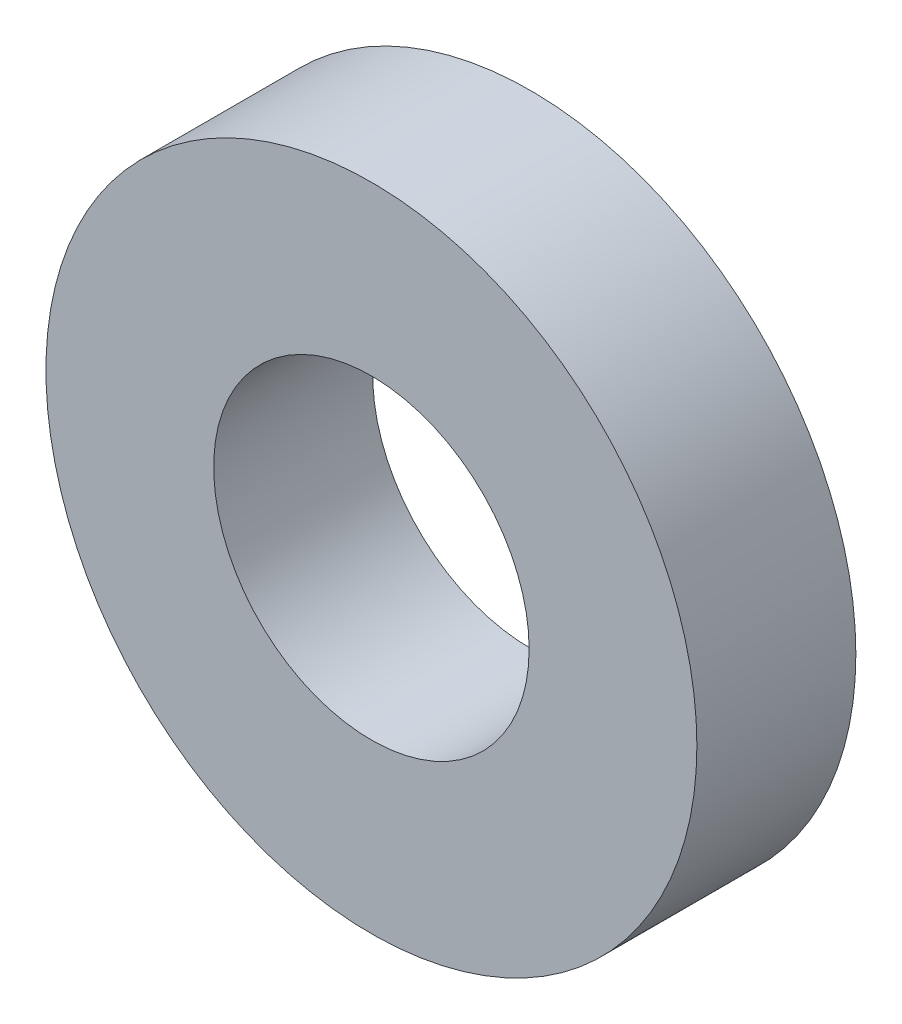
ISO-10303-21;
HEADER;
FILE_DESCRIPTION(('STEP AP214'),'2;1');
FILE_NAME('part.step','',(''),(''),'','','');
FILE_SCHEMA(('AUTOMOTIVE_DESIGN { 1 0 10303 214 1 1 1 1 }'));
ENDSEC;
DATA;
#1=APPLICATION_CONTEXT('core data for automotive mechanical design processes');
#2=APPLICATION_PROTOCOL_DEFINITION('international standard','automotive_design',2000,#1);
#3=PRODUCT_CONTEXT('',#1,'mechanical');
#4=PRODUCT('Part','Part','',(#3));
#5=PRODUCT_RELATED_PRODUCT_CATEGORY('part','',(#4));
#6=PRODUCT_DEFINITION_FORMATION('','',#4);
#7=PRODUCT_DEFINITION_CONTEXT('part definition',#1,'design');
#8=PRODUCT_DEFINITION('design','',#6,#7);
#9=PRODUCT_DEFINITION_SHAPE('','',#8);
#10=(LENGTH_UNIT() NAMED_UNIT(*) SI_UNIT(.MILLI.,.METRE.));
#11=(NAMED_UNIT(*) PLANE_ANGLE_UNIT() SI_UNIT($,.RADIAN.));
#12=(NAMED_UNIT(*) SI_UNIT($,.STERADIAN.) SOLID_ANGLE_UNIT());
#13=UNCERTAINTY_MEASURE_WITH_UNIT(LENGTH_MEASURE(1.E-05),#10,'distance_accuracy_value','');
#14=(GEOMETRIC_REPRESENTATION_CONTEXT(3) GLOBAL_UNCERTAINTY_ASSIGNED_CONTEXT((#13)) GLOBAL_UNIT_ASSIGNED_CONTEXT((#10,
#11,#12)) REPRESENTATION_CONTEXT('',''));
#15=CARTESIAN_POINT('',(0.,0.,0.));
#16=DIRECTION('',(0.,0.,1.));
#17=DIRECTION('',(1.,0.,0.));
#18=AXIS2_PLACEMENT_3D('',#15,#16,#17);
#19=CARTESIAN_POINT('',(0.,0.,1.5875));
#20=DIRECTION('',(0.,0.,1.));
#21=DIRECTION('',(1.,0.,0.));
#22=AXIS2_PLACEMENT_3D('',#19,#20,#21);
#23=PLANE('',#22);
#24=CARTESIAN_POINT('',(0.,0.,1.5875));
#25=DIRECTION('',(0.,0.,1.));
#26=DIRECTION('',(1.,0.,0.));
#27=AXIS2_PLACEMENT_3D('',#24,#25,#26);
#28=CIRCLE('',#27,6.5);
#29=CARTESIAN_POINT('',(6.5,0.,1.5875));
#30=VERTEX_POINT('',#29);
#31=EDGE_CURVE('E10',#30,#30,#28,.T.);
#32=ORIENTED_EDGE('',*,*,#31,.T.);
#33=EDGE_LOOP('',(#32));
#34=FACE_BOUND('',#33,.T.);
#35=CARTESIAN_POINT('',(0.,0.,1.5875));
#36=DIRECTION('',(0.,0.,1.));
#37=DIRECTION('',(1.,0.,0.));
#38=AXIS2_PLACEMENT_3D('',#35,#36,#37);
#39=CIRCLE('',#38,3.15);
#40=CARTESIAN_POINT('',(3.15,0.,1.5875));
#41=VERTEX_POINT('',#40);
#42=EDGE_CURVE('E50',#41,#41,#39,.T.);
#43=ORIENTED_EDGE('',*,*,#42,.F.);
#44=EDGE_LOOP('',(#43));
#45=FACE_BOUND('',#44,.T.);
#46=ADVANCED_FACE('F37',(#34,#45),#23,.T.);
#47=CARTESIAN_POINT('',(0.,0.,-1.5875));
#48=DIRECTION('',(0.,0.,1.));
#49=DIRECTION('',(1.,0.,0.));
#50=AXIS2_PLACEMENT_3D('',#47,#48,#49);
#51=PLANE('',#50);
#52=CARTESIAN_POINT('',(0.,0.,-1.5875));
#53=DIRECTION('',(0.,0.,1.));
#54=DIRECTION('',(1.,0.,0.));
#55=AXIS2_PLACEMENT_3D('',#52,#53,#54);
#56=CIRCLE('',#55,6.5);
#57=CARTESIAN_POINT('',(6.5,0.,-1.5875));
#58=VERTEX_POINT('',#57);
#59=EDGE_CURVE('E41',#58,#58,#56,.T.);
#60=ORIENTED_EDGE('',*,*,#59,.F.);
#61=EDGE_LOOP('',(#60));
#62=FACE_BOUND('',#61,.T.);
#63=CARTESIAN_POINT('',(0.,0.,-1.5875));
#64=DIRECTION('',(0.,0.,1.));
#65=DIRECTION('',(1.,0.,0.));
#66=AXIS2_PLACEMENT_3D('',#63,#64,#65);
#67=CIRCLE('',#66,3.15);
#68=CARTESIAN_POINT('',(3.15,0.,-1.5875));
#69=VERTEX_POINT('',#68);
#70=EDGE_CURVE('E52',#69,#69,#67,.T.);
#71=ORIENTED_EDGE('',*,*,#70,.T.);
#72=EDGE_LOOP('',(#71));
#73=FACE_BOUND('',#72,.T.);
#74=ADVANCED_FACE('F64',(#62,#73),#51,.F.);
#75=CARTESIAN_POINT('',(0.,0.,1.5875));
#76=DIRECTION('',(0.,0.,-1.));
#77=DIRECTION('',(-1.,0.,0.));
#78=AXIS2_PLACEMENT_3D('',#75,#76,#77);
#79=CYLINDRICAL_SURFACE('',#78,6.5);
#80=ORIENTED_EDGE('',*,*,#31,.F.);
#81=EDGE_LOOP('',(#80));
#82=FACE_BOUND('',#81,.T.);
#83=ORIENTED_EDGE('',*,*,#59,.T.);
#84=EDGE_LOOP('',(#83));
#85=FACE_BOUND('',#84,.T.);
#86=ADVANCED_FACE('F39',(#82,#85),#79,.T.);
#87=CARTESIAN_POINT('',(0.,0.,1.5875));
#88=DIRECTION('',(0.,0.,-1.));
#89=DIRECTION('',(-1.,0.,0.));
#90=AXIS2_PLACEMENT_3D('',#87,#88,#89);
#91=CYLINDRICAL_SURFACE('',#90,3.15);
#92=ORIENTED_EDGE('',*,*,#42,.T.);
#93=EDGE_LOOP('',(#92));
#94=FACE_BOUND('',#93,.T.);
#95=ORIENTED_EDGE('',*,*,#70,.F.);
#96=EDGE_LOOP('',(#95));
#97=FACE_BOUND('',#96,.T.);
#98=ADVANCED_FACE('F60',(#94,#97),#91,.F.);
#99=CLOSED_SHELL('',(#46,#74,#86,#98));
#100=MANIFOLD_SOLID_BREP('B2',#99);
#101=ADVANCED_BREP_SHAPE_REPRESENTATION('',(#18,#100),#14);
#102=SHAPE_DEFINITION_REPRESENTATION(#9,#101);
ENDSEC;
END-ISO-10303-21;
